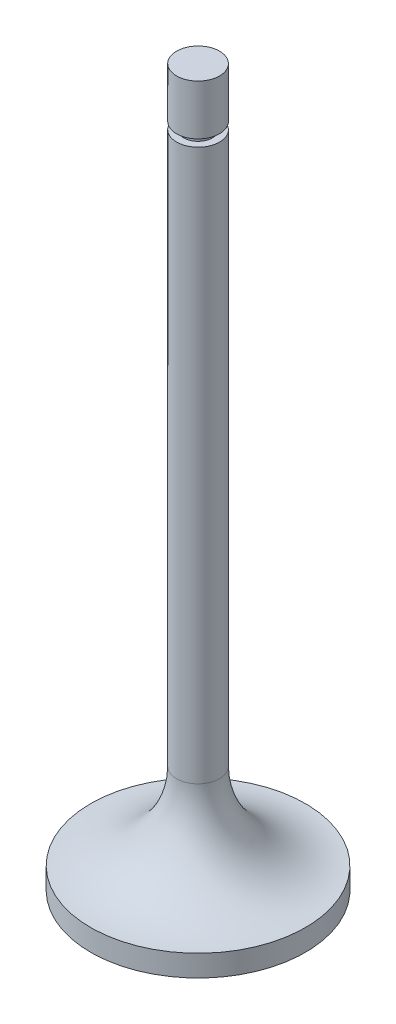
ISO-10303-21;
HEADER;
FILE_DESCRIPTION(('STEP AP214'),'2;1');
FILE_NAME('part.step','',(''),(''),'','','');
FILE_SCHEMA(('AUTOMOTIVE_DESIGN { 1 0 10303 214 1 1 1 1 }'));
ENDSEC;
DATA;
#1=APPLICATION_CONTEXT('core data for automotive mechanical design processes');
#2=APPLICATION_PROTOCOL_DEFINITION('international standard','automotive_design',2000,#1);
#3=PRODUCT_CONTEXT('',#1,'mechanical');
#4=PRODUCT('Part','Part','',(#3));
#5=PRODUCT_RELATED_PRODUCT_CATEGORY('part','',(#4));
#6=PRODUCT_DEFINITION_FORMATION('','',#4);
#7=PRODUCT_DEFINITION_CONTEXT('part definition',#1,'design');
#8=PRODUCT_DEFINITION('design','',#6,#7);
#9=PRODUCT_DEFINITION_SHAPE('','',#8);
#10=(LENGTH_UNIT() NAMED_UNIT(*) SI_UNIT(.MILLI.,.METRE.));
#11=(NAMED_UNIT(*) PLANE_ANGLE_UNIT() SI_UNIT($,.RADIAN.));
#12=(NAMED_UNIT(*) SI_UNIT($,.STERADIAN.) SOLID_ANGLE_UNIT());
#13=UNCERTAINTY_MEASURE_WITH_UNIT(LENGTH_MEASURE(1.E-05),#10,'distance_accuracy_value','');
#14=(GEOMETRIC_REPRESENTATION_CONTEXT(3) GLOBAL_UNCERTAINTY_ASSIGNED_CONTEXT((#13)) GLOBAL_UNIT_ASSIGNED_CONTEXT((#10,
#11,#12)) REPRESENTATION_CONTEXT('',''));
#15=CARTESIAN_POINT('',(0.,0.,0.));
#16=DIRECTION('',(0.,0.,1.));
#17=DIRECTION('',(1.,0.,0.));
#18=AXIS2_PLACEMENT_3D('',#15,#16,#17);
#19=CARTESIAN_POINT('',(0.,-62.1045918367347,0.));
#20=DIRECTION('',(0.,1.,0.));
#21=DIRECTION('',(-1.,0.,0.));
#22=AXIS2_PLACEMENT_3D('',#19,#20,#21);
#23=TOROIDAL_SURFACE('',#22,15.,12.);
#24=CARTESIAN_POINT('',(0.,-74.1045918367347,0.));
#25=DIRECTION('',(0.,1.,0.));
#26=DIRECTION('',(-1.,0.,0.));
#27=AXIS2_PLACEMENT_3D('',#24,#25,#26);
#28=CIRCLE('',#27,15.);
#29=CARTESIAN_POINT('',(-15.,-74.1045918367347,0.));
#30=VERTEX_POINT('',#29);
#31=EDGE_CURVE('E69',#30,#30,#28,.T.);
#32=ORIENTED_EDGE('',*,*,#31,.T.);
#33=EDGE_LOOP('',(#32));
#34=FACE_BOUND('',#33,.T.);
#35=CARTESIAN_POINT('',(0.,-62.1045918367347,0.));
#36=DIRECTION('',(0.,1.,0.));
#37=DIRECTION('',(-1.,0.,0.));
#38=AXIS2_PLACEMENT_3D('',#35,#36,#37);
#39=CIRCLE('',#38,3.00000000000001);
#40=CARTESIAN_POINT('',(-3.00000000000001,-62.1045918367347,0.));
#41=VERTEX_POINT('',#40);
#42=EDGE_CURVE('E10',#41,#41,#39,.T.);
#43=ORIENTED_EDGE('',*,*,#42,.F.);
#44=EDGE_LOOP('',(#43));
#45=FACE_BOUND('',#44,.T.);
#46=ADVANCED_FACE('F41',(#34,#45),#23,.F.);
#47=CARTESIAN_POINT('',(0.,103.649150199323,0.));
#48=DIRECTION('',(0.,1.,0.));
#49=DIRECTION('',(-1.,0.,0.));
#50=AXIS2_PLACEMENT_3D('',#47,#48,#49);
#51=CYLINDRICAL_SURFACE('',#50,3.);
#52=ORIENTED_EDGE('',*,*,#42,.T.);
#53=EDGE_LOOP('',(#52));
#54=FACE_BOUND('',#53,.T.);
#55=CARTESIAN_POINT('',(0.,14.8954081632653,0.));
#56=DIRECTION('',(0.,1.,0.));
#57=DIRECTION('',(-1.,0.,0.));
#58=AXIS2_PLACEMENT_3D('',#55,#56,#57);
#59=CIRCLE('',#58,3.);
#60=CARTESIAN_POINT('',(-3.00000000000001,14.8954081632653,0.));
#61=VERTEX_POINT('',#60);
#62=EDGE_CURVE('E47',#61,#61,#59,.T.);
#63=ORIENTED_EDGE('',*,*,#62,.F.);
#64=EDGE_LOOP('',(#63));
#65=FACE_BOUND('',#64,.T.);
#66=ADVANCED_FACE('F92',(#54,#65),#51,.T.);
#67=CARTESIAN_POINT('',(0.,14.8954081632653,0.));
#68=DIRECTION('',(0.,-1.,0.));
#69=DIRECTION('',(1.,0.,0.));
#70=AXIS2_PLACEMENT_3D('',#67,#68,#69);
#71=PLANE('',#70);
#72=CARTESIAN_POINT('',(0.,14.8954081632653,0.));
#73=DIRECTION('',(0.,1.,0.));
#74=DIRECTION('',(-1.,0.,0.));
#75=AXIS2_PLACEMENT_3D('',#72,#73,#74);
#76=CIRCLE('',#75,2.);
#77=CARTESIAN_POINT('',(-2.,14.8954081632653,0.));
#78=VERTEX_POINT('',#77);
#79=EDGE_CURVE('E51',#78,#78,#76,.T.);
#80=ORIENTED_EDGE('',*,*,#79,.F.);
#81=EDGE_LOOP('',(#80));
#82=FACE_BOUND('',#81,.T.);
#83=ORIENTED_EDGE('',*,*,#62,.T.);
#84=EDGE_LOOP('',(#83));
#85=FACE_BOUND('',#84,.T.);
#86=ADVANCED_FACE('F96',(#82,#85),#71,.F.);
#87=CARTESIAN_POINT('',(0.,103.649150199323,0.));
#88=DIRECTION('',(0.,1.,0.));
#89=DIRECTION('',(-1.,0.,0.));
#90=AXIS2_PLACEMENT_3D('',#87,#88,#89);
#91=CYLINDRICAL_SURFACE('',#90,2.);
#92=ORIENTED_EDGE('',*,*,#79,.T.);
#93=EDGE_LOOP('',(#92));
#94=FACE_BOUND('',#93,.T.);
#95=CARTESIAN_POINT('',(0.,15.8954081632653,0.));
#96=DIRECTION('',(0.,1.,0.));
#97=DIRECTION('',(-1.,0.,0.));
#98=AXIS2_PLACEMENT_3D('',#95,#96,#97);
#99=CIRCLE('',#98,2.);
#100=CARTESIAN_POINT('',(-2.,15.8954081632653,0.));
#101=VERTEX_POINT('',#100);
#102=EDGE_CURVE('E55',#101,#101,#99,.T.);
#103=ORIENTED_EDGE('',*,*,#102,.F.);
#104=EDGE_LOOP('',(#103));
#105=FACE_BOUND('',#104,.T.);
#106=ADVANCED_FACE('F101',(#94,#105),#91,.T.);
#107=CARTESIAN_POINT('',(0.,15.8954081632653,0.));
#108=DIRECTION('',(0.,-1.,0.));
#109=DIRECTION('',(1.,0.,0.));
#110=AXIS2_PLACEMENT_3D('',#107,#108,#109);
#111=PLANE('',#110);
#112=ORIENTED_EDGE('',*,*,#102,.T.);
#113=EDGE_LOOP('',(#112));
#114=FACE_BOUND('',#113,.T.);
#115=CARTESIAN_POINT('',(0.,15.8954081632653,0.));
#116=DIRECTION('',(0.,1.,0.));
#117=DIRECTION('',(-1.,0.,0.));
#118=AXIS2_PLACEMENT_3D('',#115,#116,#117);
#119=CIRCLE('',#118,3.);
#120=CARTESIAN_POINT('',(-3.00000000000001,15.8954081632653,0.));
#121=VERTEX_POINT('',#120);
#122=EDGE_CURVE('E60',#121,#121,#119,.T.);
#123=ORIENTED_EDGE('',*,*,#122,.F.);
#124=EDGE_LOOP('',(#123));
#125=FACE_BOUND('',#124,.T.);
#126=ADVANCED_FACE('F106',(#114,#125),#111,.T.);
#127=ORIENTED_EDGE('',*,*,#122,.T.);
#128=EDGE_LOOP('',(#127));
#129=FACE_BOUND('',#128,.T.);
#130=CARTESIAN_POINT('',(0.,22.8954081632653,0.));
#131=DIRECTION('',(0.,1.,0.));
#132=DIRECTION('',(-1.,0.,0.));
#133=AXIS2_PLACEMENT_3D('',#130,#131,#132);
#134=CIRCLE('',#133,3.);
#135=CARTESIAN_POINT('',(-3.00000000000001,22.8954081632653,0.));
#136=VERTEX_POINT('',#135);
#137=EDGE_CURVE('E63',#136,#136,#134,.T.);
#138=ORIENTED_EDGE('',*,*,#137,.F.);
#139=EDGE_LOOP('',(#138));
#140=FACE_BOUND('',#139,.T.);
#141=ADVANCED_FACE('F88',(#129,#140),#51,.T.);
#142=CARTESIAN_POINT('',(0.,22.8954081632653,0.));
#143=DIRECTION('',(0.,1.,0.));
#144=DIRECTION('',(-1.,0.,0.));
#145=AXIS2_PLACEMENT_3D('',#142,#143,#144);
#146=PLANE('',#145);
#147=ORIENTED_EDGE('',*,*,#137,.T.);
#148=EDGE_LOOP('',(#147));
#149=FACE_BOUND('',#148,.T.);
#150=ADVANCED_FACE('F83',(#149),#146,.T.);
#151=CARTESIAN_POINT('',(0.,-77.1045918367347,0.));
#152=DIRECTION('',(0.,1.,0.));
#153=DIRECTION('',(-1.,0.,0.));
#154=AXIS2_PLACEMENT_3D('',#151,#152,#153);
#155=PLANE('',#154);
#156=CARTESIAN_POINT('',(0.,-77.1045918367347,0.));
#157=DIRECTION('',(0.,1.,0.));
#158=DIRECTION('',(-1.,0.,0.));
#159=AXIS2_PLACEMENT_3D('',#156,#157,#158);
#160=CIRCLE('',#159,15.);
#161=CARTESIAN_POINT('',(-15.,-77.1045918367347,0.));
#162=VERTEX_POINT('',#161);
#163=EDGE_CURVE('E66',#162,#162,#160,.T.);
#164=ORIENTED_EDGE('',*,*,#163,.F.);
#165=EDGE_LOOP('',(#164));
#166=FACE_BOUND('',#165,.T.);
#167=ADVANCED_FACE('F78',(#166),#155,.F.);
#168=CARTESIAN_POINT('',(0.,103.649150199323,0.));
#169=DIRECTION('',(0.,1.,0.));
#170=DIRECTION('',(-1.,0.,0.));
#171=AXIS2_PLACEMENT_3D('',#168,#169,#170);
#172=CYLINDRICAL_SURFACE('',#171,15.);
#173=ORIENTED_EDGE('',*,*,#31,.F.);
#174=EDGE_LOOP('',(#173));
#175=FACE_BOUND('',#174,.T.);
#176=ORIENTED_EDGE('',*,*,#163,.T.);
#177=EDGE_LOOP('',(#176));
#178=FACE_BOUND('',#177,.T.);
#179=ADVANCED_FACE('F75',(#175,#178),#172,.T.);
#180=CLOSED_SHELL('',(#46,#66,#86,#106,#126,#141,#150,#167,#179));
#181=MANIFOLD_SOLID_BREP('B2',#180);
#182=ADVANCED_BREP_SHAPE_REPRESENTATION('',(#18,#181),#14);
#183=SHAPE_DEFINITION_REPRESENTATION(#9,#182);
ENDSEC;
END-ISO-10303-21;
